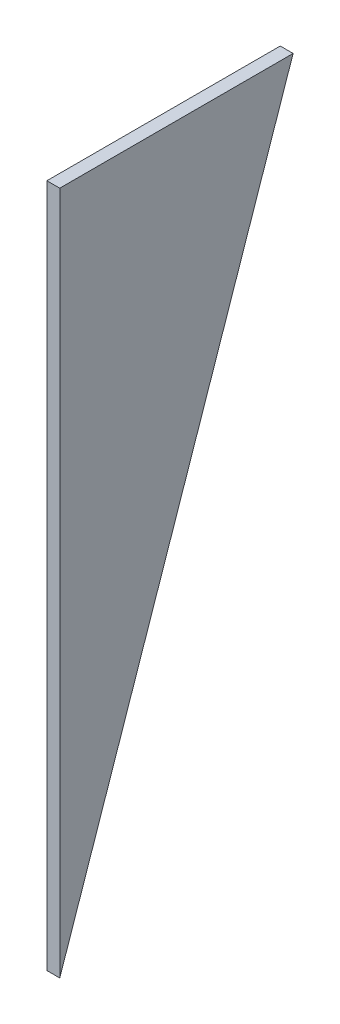
ISO-10303-21;
HEADER;
FILE_DESCRIPTION(('STEP AP214'),'2;1');
FILE_NAME('part.step','',(''),(''),'','','');
FILE_SCHEMA(('AUTOMOTIVE_DESIGN { 1 0 10303 214 1 1 1 1 }'));
ENDSEC;
DATA;
#1=APPLICATION_CONTEXT('core data for automotive mechanical design processes');
#2=APPLICATION_PROTOCOL_DEFINITION('international standard','automotive_design',2000,#1);
#3=PRODUCT_CONTEXT('',#1,'mechanical');
#4=PRODUCT('Part','Part','',(#3));
#5=PRODUCT_RELATED_PRODUCT_CATEGORY('part','',(#4));
#6=PRODUCT_DEFINITION_FORMATION('','',#4);
#7=PRODUCT_DEFINITION_CONTEXT('part definition',#1,'design');
#8=PRODUCT_DEFINITION('design','',#6,#7);
#9=PRODUCT_DEFINITION_SHAPE('','',#8);
#10=(LENGTH_UNIT() NAMED_UNIT(*) SI_UNIT(.MILLI.,.METRE.));
#11=(NAMED_UNIT(*) PLANE_ANGLE_UNIT() SI_UNIT($,.RADIAN.));
#12=(NAMED_UNIT(*) SI_UNIT($,.STERADIAN.) SOLID_ANGLE_UNIT());
#13=UNCERTAINTY_MEASURE_WITH_UNIT(LENGTH_MEASURE(1.E-05),#10,'distance_accuracy_value','');
#14=(GEOMETRIC_REPRESENTATION_CONTEXT(3) GLOBAL_UNCERTAINTY_ASSIGNED_CONTEXT((#13)) GLOBAL_UNIT_ASSIGNED_CONTEXT((#10,
#11,#12)) REPRESENTATION_CONTEXT('',''));
#15=CARTESIAN_POINT('',(0.,0.,0.));
#16=DIRECTION('',(0.,0.,1.));
#17=DIRECTION('',(1.,0.,0.));
#18=AXIS2_PLACEMENT_3D('',#15,#16,#17);
#19=CARTESIAN_POINT('',(16.,0.,0.));
#20=DIRECTION('',(0.,0.,-1.));
#21=DIRECTION('',(-1.,0.,0.));
#22=AXIS2_PLACEMENT_3D('',#19,#20,#21);
#23=PLANE('',#22);
#24=DIRECTION('',(0.,-1.,0.));
#25=VECTOR('',#24,1.);
#26=CARTESIAN_POINT('',(0.,0.,0.));
#27=LINE('',#26,#25);
#28=CARTESIAN_POINT('',(0.,850.,0.));
#29=VERTEX_POINT('',#28);
#30=CARTESIAN_POINT('',(0.,0.,0.));
#31=VERTEX_POINT('',#30);
#32=EDGE_CURVE('E78',#29,#31,#27,.T.);
#33=ORIENTED_EDGE('',*,*,#32,.T.);
#34=DIRECTION('',(-1.,0.,0.));
#35=VECTOR('',#34,1.);
#36=CARTESIAN_POINT('',(16.,0.,0.));
#37=LINE('',#36,#35);
#38=CARTESIAN_POINT('',(16.,0.,0.));
#39=VERTEX_POINT('',#38);
#40=EDGE_CURVE('E11',#39,#31,#37,.T.);
#41=ORIENTED_EDGE('',*,*,#40,.F.);
#42=DIRECTION('',(0.,-1.,0.));
#43=VECTOR('',#42,1.);
#44=CARTESIAN_POINT('',(16.,0.,0.));
#45=LINE('',#44,#43);
#46=CARTESIAN_POINT('',(16.,850.,0.));
#47=VERTEX_POINT('',#46);
#48=EDGE_CURVE('E71',#47,#39,#45,.T.);
#49=ORIENTED_EDGE('',*,*,#48,.F.);
#50=DIRECTION('',(-1.,0.,0.));
#51=VECTOR('',#50,1.);
#52=CARTESIAN_POINT('',(16.,850.,0.));
#53=LINE('',#52,#51);
#54=EDGE_CURVE('E79',#47,#29,#53,.T.);
#55=ORIENTED_EDGE('',*,*,#54,.T.);
#56=EDGE_LOOP('',(#33,#41,#49,#55));
#57=FACE_BOUND('',#56,.T.);
#58=ADVANCED_FACE('F31',(#57),#23,.F.);
#59=CARTESIAN_POINT('',(16.,850.,-290.));
#60=DIRECTION('',(0.,0.322900627552796,0.946432873861644));
#61=DIRECTION('',(0.,-0.946432873861644,0.322900627552796));
#62=AXIS2_PLACEMENT_3D('',#59,#60,#61);
#63=PLANE('',#62);
#64=DIRECTION('',(0.,0.946432873861644,-0.322900627552796));
#65=VECTOR('',#64,1.);
#66=CARTESIAN_POINT('',(0.,850.,-290.));
#67=LINE('',#66,#65);
#68=CARTESIAN_POINT('',(0.,850.,-290.));
#69=VERTEX_POINT('',#68);
#70=EDGE_CURVE('E59',#31,#69,#67,.T.);
#71=ORIENTED_EDGE('',*,*,#70,.T.);
#72=DIRECTION('',(-1.,0.,0.));
#73=VECTOR('',#72,1.);
#74=CARTESIAN_POINT('',(16.,850.,-290.));
#75=LINE('',#74,#73);
#76=CARTESIAN_POINT('',(16.,850.,-290.));
#77=VERTEX_POINT('',#76);
#78=EDGE_CURVE('E39',#77,#69,#75,.T.);
#79=ORIENTED_EDGE('',*,*,#78,.F.);
#80=DIRECTION('',(0.,0.946432873861644,-0.322900627552796));
#81=VECTOR('',#80,1.);
#82=CARTESIAN_POINT('',(16.,850.,-290.));
#83=LINE('',#82,#81);
#84=EDGE_CURVE('E67',#39,#77,#83,.T.);
#85=ORIENTED_EDGE('',*,*,#84,.F.);
#86=ORIENTED_EDGE('',*,*,#40,.T.);
#87=EDGE_LOOP('',(#71,#79,#85,#86));
#88=FACE_BOUND('',#87,.T.);
#89=ADVANCED_FACE('F68',(#88),#63,.F.);
#90=CARTESIAN_POINT('',(16.,850.,0.));
#91=DIRECTION('',(0.,-1.,0.));
#92=DIRECTION('',(0.,0.,-1.));
#93=AXIS2_PLACEMENT_3D('',#90,#91,#92);
#94=PLANE('',#93);
#95=DIRECTION('',(0.,0.,1.));
#96=VECTOR('',#95,1.);
#97=CARTESIAN_POINT('',(0.,850.,0.));
#98=LINE('',#97,#96);
#99=EDGE_CURVE('E64',#69,#29,#98,.T.);
#100=ORIENTED_EDGE('',*,*,#99,.T.);
#101=ORIENTED_EDGE('',*,*,#54,.F.);
#102=DIRECTION('',(0.,0.,1.));
#103=VECTOR('',#102,1.);
#104=CARTESIAN_POINT('',(16.,850.,0.));
#105=LINE('',#104,#103);
#106=EDGE_CURVE('E47',#77,#47,#105,.T.);
#107=ORIENTED_EDGE('',*,*,#106,.F.);
#108=ORIENTED_EDGE('',*,*,#78,.T.);
#109=EDGE_LOOP('',(#100,#101,#107,#108));
#110=FACE_BOUND('',#109,.T.);
#111=ADVANCED_FACE('F86',(#110),#94,.F.);
#112=CARTESIAN_POINT('',(16.,850.,0.));
#113=DIRECTION('',(-1.,0.,0.));
#114=DIRECTION('',(0.,0.,1.));
#115=AXIS2_PLACEMENT_3D('',#112,#113,#114);
#116=PLANE('',#115);
#117=ORIENTED_EDGE('',*,*,#48,.T.);
#118=ORIENTED_EDGE('',*,*,#84,.T.);
#119=ORIENTED_EDGE('',*,*,#106,.T.);
#120=EDGE_LOOP('',(#117,#118,#119));
#121=FACE_BOUND('',#120,.T.);
#122=ADVANCED_FACE('F74',(#121),#116,.F.);
#123=CARTESIAN_POINT('',(0.,850.,0.));
#124=DIRECTION('',(-1.,0.,0.));
#125=DIRECTION('',(0.,0.,1.));
#126=AXIS2_PLACEMENT_3D('',#123,#124,#125);
#127=PLANE('',#126);
#128=ORIENTED_EDGE('',*,*,#32,.F.);
#129=ORIENTED_EDGE('',*,*,#99,.F.);
#130=ORIENTED_EDGE('',*,*,#70,.F.);
#131=EDGE_LOOP('',(#128,#129,#130));
#132=FACE_BOUND('',#131,.T.);
#133=ADVANCED_FACE('F87',(#132),#127,.T.);
#134=CLOSED_SHELL('',(#58,#89,#111,#122,#133));
#135=MANIFOLD_SOLID_BREP('B2',#134);
#136=ADVANCED_BREP_SHAPE_REPRESENTATION('',(#18,#135),#14);
#137=SHAPE_DEFINITION_REPRESENTATION(#9,#136);
ENDSEC;
END-ISO-10303-21;
